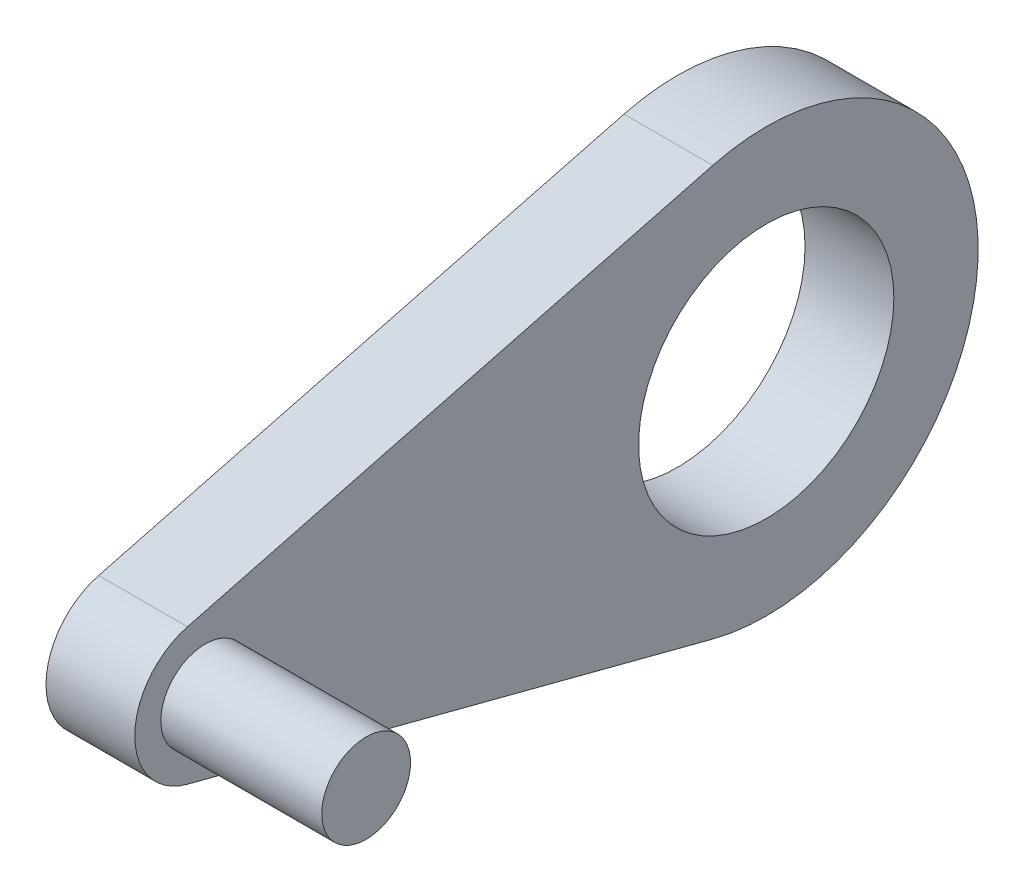
ISO-10303-21;
HEADER;
FILE_DESCRIPTION(('STEP AP214'),'2;1');
FILE_NAME('part.step','',(''),(''),'','','');
FILE_SCHEMA(('AUTOMOTIVE_DESIGN { 1 0 10303 214 1 1 1 1 }'));
ENDSEC;
DATA;
#1=APPLICATION_CONTEXT('core data for automotive mechanical design processes');
#2=APPLICATION_PROTOCOL_DEFINITION('international standard','automotive_design',2000,#1);
#3=PRODUCT_CONTEXT('',#1,'mechanical');
#4=PRODUCT('Part','Part','',(#3));
#5=PRODUCT_RELATED_PRODUCT_CATEGORY('part','',(#4));
#6=PRODUCT_DEFINITION_FORMATION('','',#4);
#7=PRODUCT_DEFINITION_CONTEXT('part definition',#1,'design');
#8=PRODUCT_DEFINITION('design','',#6,#7);
#9=PRODUCT_DEFINITION_SHAPE('','',#8);
#10=(LENGTH_UNIT() NAMED_UNIT(*) SI_UNIT(.MILLI.,.METRE.));
#11=(NAMED_UNIT(*) PLANE_ANGLE_UNIT() SI_UNIT($,.RADIAN.));
#12=(NAMED_UNIT(*) SI_UNIT($,.STERADIAN.) SOLID_ANGLE_UNIT());
#13=UNCERTAINTY_MEASURE_WITH_UNIT(LENGTH_MEASURE(1.E-05),#10,'distance_accuracy_value','');
#14=(GEOMETRIC_REPRESENTATION_CONTEXT(3) GLOBAL_UNCERTAINTY_ASSIGNED_CONTEXT((#13)) GLOBAL_UNIT_ASSIGNED_CONTEXT((#10,
#11,#12)) REPRESENTATION_CONTEXT('',''));
#15=CARTESIAN_POINT('',(0.,0.,0.));
#16=DIRECTION('',(0.,0.,1.));
#17=DIRECTION('',(1.,0.,0.));
#18=AXIS2_PLACEMENT_3D('',#15,#16,#17);
#19=CARTESIAN_POINT('',(0.,0.,0.));
#20=DIRECTION('',(1.,0.,0.));
#21=DIRECTION('',(0.,0.,-1.));
#22=AXIS2_PLACEMENT_3D('',#19,#20,#21);
#23=PLANE('',#22);
#24=CARTESIAN_POINT('',(0.,0.,-101.1));
#25=DIRECTION('',(1.,0.,0.));
#26=DIRECTION('',(0.,0.,-1.));
#27=AXIS2_PLACEMENT_3D('',#24,#25,#26);
#28=CIRCLE('',#27,23.);
#29=CARTESIAN_POINT('',(0.,0.,-124.1));
#30=VERTEX_POINT('',#29);
#31=EDGE_CURVE('E145',#30,#30,#28,.T.);
#32=ORIENTED_EDGE('',*,*,#31,.F.);
#33=EDGE_LOOP('',(#32));
#34=FACE_BOUND('',#33,.T.);
#35=CARTESIAN_POINT('',(0.,0.,0.));
#36=DIRECTION('',(1.,0.,0.));
#37=DIRECTION('',(0.,0.,-1.));
#38=AXIS2_PLACEMENT_3D('',#35,#36,#37);
#39=CIRCLE('',#38,12.7);
#40=CARTESIAN_POINT('',(0.,12.2893896975387,3.20326409495549));
#41=VERTEX_POINT('',#40);
#42=CARTESIAN_POINT('',(0.,-12.2893896975386,3.20326409495549));
#43=VERTEX_POINT('',#42);
#44=EDGE_CURVE('E98',#41,#43,#39,.T.);
#45=ORIENTED_EDGE('',*,*,#44,.T.);
#46=DIRECTION('',(0.,-0.252225519287834,-0.967668480121153));
#47=VECTOR('',#46,1.);
#48=CARTESIAN_POINT('',(0.,-36.9649359406281,-91.4649851632047));
#49=LINE('',#48,#47);
#50=CARTESIAN_POINT('',(0.,-36.9649359406281,-91.4649851632047));
#51=VERTEX_POINT('',#50);
#52=EDGE_CURVE('E101',#43,#51,#49,.T.);
#53=ORIENTED_EDGE('',*,*,#52,.T.);
#54=CARTESIAN_POINT('',(0.,0.,-101.1));
#55=DIRECTION('',(1.,0.,0.));
#56=DIRECTION('',(0.,0.,-1.));
#57=AXIS2_PLACEMENT_3D('',#54,#55,#56);
#58=CIRCLE('',#57,38.2);
#59=CARTESIAN_POINT('',(0.,36.9649359406281,-91.4649851632047));
#60=VERTEX_POINT('',#59);
#61=EDGE_CURVE('E83',#51,#60,#58,.T.);
#62=ORIENTED_EDGE('',*,*,#61,.T.);
#63=DIRECTION('',(0.,-0.252225519287834,0.967668480121153));
#64=VECTOR('',#63,1.);
#65=CARTESIAN_POINT('',(0.,12.2893896975387,3.20326409495549));
#66=LINE('',#65,#64);
#67=EDGE_CURVE('E93',#60,#41,#66,.T.);
#68=ORIENTED_EDGE('',*,*,#67,.T.);
#69=EDGE_LOOP('',(#45,#53,#62,#68));
#70=FACE_BOUND('',#69,.T.);
#71=CARTESIAN_POINT('',(0.,0.,0.));
#72=DIRECTION('',(1.,0.,0.));
#73=DIRECTION('',(0.,0.,-1.));
#74=AXIS2_PLACEMENT_3D('',#71,#72,#73);
#75=CIRCLE('',#74,8.);
#76=CARTESIAN_POINT('',(0.,0.,-8.));
#77=VERTEX_POINT('',#76);
#78=EDGE_CURVE('E147',#77,#77,#75,.T.);
#79=ORIENTED_EDGE('',*,*,#78,.F.);
#80=EDGE_LOOP('',(#79));
#81=FACE_BOUND('',#80,.T.);
#82=ADVANCED_FACE('F32',(#34,#70,#81),#23,.T.);
#83=CARTESIAN_POINT('',(-16.,0.,0.));
#84=DIRECTION('',(1.,0.,0.));
#85=DIRECTION('',(0.,0.,-1.));
#86=AXIS2_PLACEMENT_3D('',#83,#84,#85);
#87=CYLINDRICAL_SURFACE('',#86,12.7);
#88=ORIENTED_EDGE('',*,*,#44,.F.);
#89=DIRECTION('',(1.,0.,0.));
#90=VECTOR('',#89,1.);
#91=CARTESIAN_POINT('',(-16.,12.2893896975387,3.20326409495549));
#92=LINE('',#91,#90);
#93=CARTESIAN_POINT('',(-16.,12.2893896975387,3.20326409495549));
#94=VERTEX_POINT('',#93);
#95=EDGE_CURVE('E11',#94,#41,#92,.T.);
#96=ORIENTED_EDGE('',*,*,#95,.F.);
#97=CARTESIAN_POINT('',(-16.,0.,0.));
#98=DIRECTION('',(1.,0.,0.));
#99=DIRECTION('',(0.,0.,-1.));
#100=AXIS2_PLACEMENT_3D('',#97,#98,#99);
#101=CIRCLE('',#100,12.7);
#102=CARTESIAN_POINT('',(-16.,-12.2893896975386,3.20326409495549));
#103=VERTEX_POINT('',#102);
#104=EDGE_CURVE('E91',#94,#103,#101,.T.);
#105=ORIENTED_EDGE('',*,*,#104,.T.);
#106=DIRECTION('',(1.,0.,0.));
#107=VECTOR('',#106,1.);
#108=CARTESIAN_POINT('',(-16.,-12.2893896975386,3.20326409495549));
#109=LINE('',#108,#107);
#110=EDGE_CURVE('E36',#103,#43,#109,.T.);
#111=ORIENTED_EDGE('',*,*,#110,.T.);
#112=EDGE_LOOP('',(#88,#96,#105,#111));
#113=FACE_BOUND('',#112,.T.);
#114=ADVANCED_FACE('F34',(#113),#87,.T.);
#115=CARTESIAN_POINT('',(-16.,12.2893896975387,3.20326409495549));
#116=DIRECTION('',(0.,0.967668480121153,0.252225519287834));
#117=DIRECTION('',(0.,-0.252225519287834,0.967668480121153));
#118=AXIS2_PLACEMENT_3D('',#115,#116,#117);
#119=PLANE('',#118);
#120=ORIENTED_EDGE('',*,*,#67,.F.);
#121=DIRECTION('',(1.,0.,0.));
#122=VECTOR('',#121,1.);
#123=CARTESIAN_POINT('',(-16.,36.9649359406281,-91.4649851632047));
#124=LINE('',#123,#122);
#125=CARTESIAN_POINT('',(-16.,36.9649359406281,-91.4649851632047));
#126=VERTEX_POINT('',#125);
#127=EDGE_CURVE('E42',#126,#60,#124,.T.);
#128=ORIENTED_EDGE('',*,*,#127,.F.);
#129=DIRECTION('',(0.,-0.252225519287834,0.967668480121153));
#130=VECTOR('',#129,1.);
#131=CARTESIAN_POINT('',(-16.,12.2893896975387,3.20326409495549));
#132=LINE('',#131,#130);
#133=EDGE_CURVE('E88',#126,#94,#132,.T.);
#134=ORIENTED_EDGE('',*,*,#133,.T.);
#135=ORIENTED_EDGE('',*,*,#95,.T.);
#136=EDGE_LOOP('',(#120,#128,#134,#135));
#137=FACE_BOUND('',#136,.T.);
#138=ADVANCED_FACE('F109',(#137),#119,.T.);
#139=CARTESIAN_POINT('',(-16.,0.,-101.1));
#140=DIRECTION('',(1.,0.,0.));
#141=DIRECTION('',(0.,0.,-1.));
#142=AXIS2_PLACEMENT_3D('',#139,#140,#141);
#143=CYLINDRICAL_SURFACE('',#142,38.2);
#144=ORIENTED_EDGE('',*,*,#61,.F.);
#145=DIRECTION('',(1.,0.,0.));
#146=VECTOR('',#145,1.);
#147=CARTESIAN_POINT('',(-16.,-36.9649359406281,-91.4649851632047));
#148=LINE('',#147,#146);
#149=CARTESIAN_POINT('',(-16.,-36.9649359406281,-91.4649851632047));
#150=VERTEX_POINT('',#149);
#151=EDGE_CURVE('E78',#150,#51,#148,.T.);
#152=ORIENTED_EDGE('',*,*,#151,.F.);
#153=CARTESIAN_POINT('',(-16.,0.,-101.1));
#154=DIRECTION('',(1.,0.,0.));
#155=DIRECTION('',(0.,0.,-1.));
#156=AXIS2_PLACEMENT_3D('',#153,#154,#155);
#157=CIRCLE('',#156,38.2);
#158=EDGE_CURVE('E81',#150,#126,#157,.T.);
#159=ORIENTED_EDGE('',*,*,#158,.T.);
#160=ORIENTED_EDGE('',*,*,#127,.T.);
#161=EDGE_LOOP('',(#144,#152,#159,#160));
#162=FACE_BOUND('',#161,.T.);
#163=ADVANCED_FACE('F80',(#162),#143,.T.);
#164=CARTESIAN_POINT('',(-16.,-36.9649359406281,-91.4649851632047));
#165=DIRECTION('',(0.,-0.967668480121153,0.252225519287834));
#166=DIRECTION('',(0.,-0.252225519287834,-0.967668480121153));
#167=AXIS2_PLACEMENT_3D('',#164,#165,#166);
#168=PLANE('',#167);
#169=ORIENTED_EDGE('',*,*,#52,.F.);
#170=ORIENTED_EDGE('',*,*,#110,.F.);
#171=DIRECTION('',(0.,-0.252225519287834,-0.967668480121153));
#172=VECTOR('',#171,1.);
#173=CARTESIAN_POINT('',(-16.,-36.9649359406281,-91.4649851632047));
#174=LINE('',#173,#172);
#175=EDGE_CURVE('E87',#103,#150,#174,.T.);
#176=ORIENTED_EDGE('',*,*,#175,.T.);
#177=ORIENTED_EDGE('',*,*,#151,.T.);
#178=EDGE_LOOP('',(#169,#170,#176,#177));
#179=FACE_BOUND('',#178,.T.);
#180=ADVANCED_FACE('F90',(#179),#168,.T.);
#181=CARTESIAN_POINT('',(-16.,0.,0.));
#182=DIRECTION('',(1.,0.,0.));
#183=DIRECTION('',(0.,0.,-1.));
#184=AXIS2_PLACEMENT_3D('',#181,#182,#183);
#185=PLANE('',#184);
#186=CARTESIAN_POINT('',(-16.,0.,-101.1));
#187=DIRECTION('',(1.,0.,0.));
#188=DIRECTION('',(0.,0.,-1.));
#189=AXIS2_PLACEMENT_3D('',#186,#187,#188);
#190=CIRCLE('',#189,23.);
#191=CARTESIAN_POINT('',(-16.,0.,-124.1));
#192=VERTEX_POINT('',#191);
#193=EDGE_CURVE('E143',#192,#192,#190,.T.);
#194=ORIENTED_EDGE('',*,*,#193,.T.);
#195=EDGE_LOOP('',(#194));
#196=FACE_BOUND('',#195,.T.);
#197=ORIENTED_EDGE('',*,*,#104,.F.);
#198=ORIENTED_EDGE('',*,*,#133,.F.);
#199=ORIENTED_EDGE('',*,*,#158,.F.);
#200=ORIENTED_EDGE('',*,*,#175,.F.);
#201=EDGE_LOOP('',(#197,#198,#199,#200));
#202=FACE_BOUND('',#201,.T.);
#203=ADVANCED_FACE('F86',(#196,#202),#185,.F.);
#204=CARTESIAN_POINT('',(29.,0.,0.));
#205=DIRECTION('',(-1.,0.,0.));
#206=DIRECTION('',(0.,0.,1.));
#207=AXIS2_PLACEMENT_3D('',#204,#205,#206);
#208=CYLINDRICAL_SURFACE('',#207,8.);
#209=CARTESIAN_POINT('',(29.,0.,0.));
#210=DIRECTION('',(1.,0.,0.));
#211=DIRECTION('',(0.,0.,-1.));
#212=AXIS2_PLACEMENT_3D('',#209,#210,#211);
#213=CIRCLE('',#212,8.);
#214=CARTESIAN_POINT('',(29.,0.,-8.));
#215=VERTEX_POINT('',#214);
#216=EDGE_CURVE('E102',#215,#215,#213,.T.);
#217=ORIENTED_EDGE('',*,*,#216,.F.);
#218=EDGE_LOOP('',(#217));
#219=FACE_BOUND('',#218,.T.);
#220=ORIENTED_EDGE('',*,*,#78,.T.);
#221=EDGE_LOOP('',(#220));
#222=FACE_BOUND('',#221,.T.);
#223=ADVANCED_FACE('F126',(#219,#222),#208,.T.);
#224=CARTESIAN_POINT('',(29.,0.,0.));
#225=DIRECTION('',(1.,0.,0.));
#226=DIRECTION('',(0.,0.,-1.));
#227=AXIS2_PLACEMENT_3D('',#224,#225,#226);
#228=PLANE('',#227);
#229=ORIENTED_EDGE('',*,*,#216,.T.);
#230=EDGE_LOOP('',(#229));
#231=FACE_BOUND('',#230,.T.);
#232=ADVANCED_FACE('F130',(#231),#228,.T.);
#233=CARTESIAN_POINT('',(-16.,0.,-101.1));
#234=DIRECTION('',(1.,0.,0.));
#235=DIRECTION('',(0.,0.,-1.));
#236=AXIS2_PLACEMENT_3D('',#233,#234,#235);
#237=CYLINDRICAL_SURFACE('',#236,23.);
#238=ORIENTED_EDGE('',*,*,#193,.F.);
#239=EDGE_LOOP('',(#238));
#240=FACE_BOUND('',#239,.T.);
#241=ORIENTED_EDGE('',*,*,#31,.T.);
#242=EDGE_LOOP('',(#241));
#243=FACE_BOUND('',#242,.T.);
#244=ADVANCED_FACE('F134',(#240,#243),#237,.F.);
#245=CLOSED_SHELL('',(#82,#114,#138,#163,#180,#203,#223,#232,#244));
#246=MANIFOLD_SOLID_BREP('B2',#245);
#247=ADVANCED_BREP_SHAPE_REPRESENTATION('',(#18,#246),#14);
#248=SHAPE_DEFINITION_REPRESENTATION(#9,#247);
ENDSEC;
END-ISO-10303-21;
